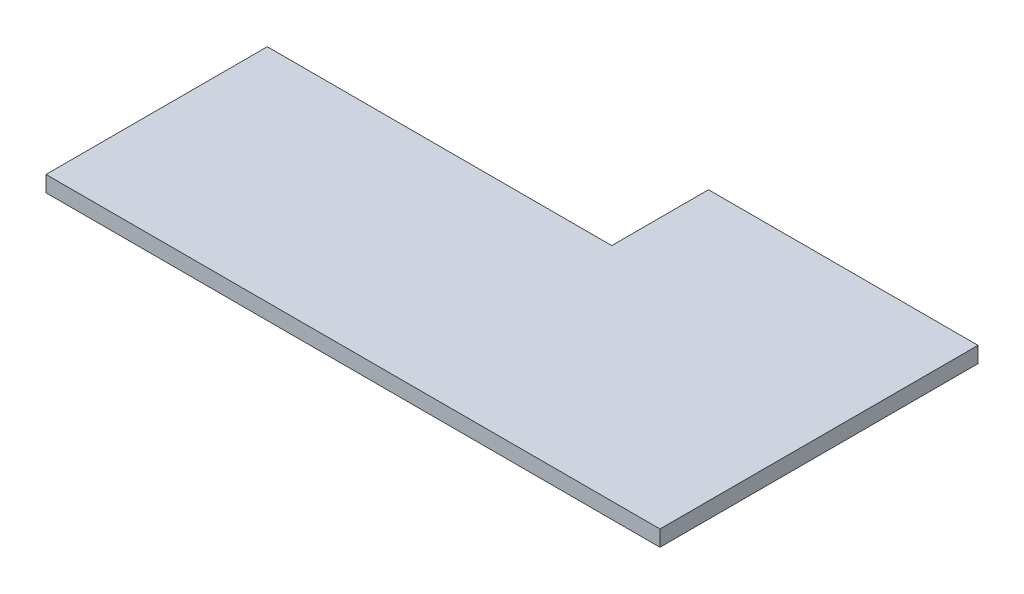
ISO-10303-21;
HEADER;
FILE_DESCRIPTION(('STEP AP214'),'2;1');
FILE_NAME('part.step','',(''),(''),'','','');
FILE_SCHEMA(('AUTOMOTIVE_DESIGN { 1 0 10303 214 1 1 1 1 }'));
ENDSEC;
DATA;
#1=APPLICATION_CONTEXT('core data for automotive mechanical design processes');
#2=APPLICATION_PROTOCOL_DEFINITION('international standard','automotive_design',2000,#1);
#3=PRODUCT_CONTEXT('',#1,'mechanical');
#4=PRODUCT('Part','Part','',(#3));
#5=PRODUCT_RELATED_PRODUCT_CATEGORY('part','',(#4));
#6=PRODUCT_DEFINITION_FORMATION('','',#4);
#7=PRODUCT_DEFINITION_CONTEXT('part definition',#1,'design');
#8=PRODUCT_DEFINITION('design','',#6,#7);
#9=PRODUCT_DEFINITION_SHAPE('','',#8);
#10=(LENGTH_UNIT() NAMED_UNIT(*) SI_UNIT(.MILLI.,.METRE.));
#11=(NAMED_UNIT(*) PLANE_ANGLE_UNIT() SI_UNIT($,.RADIAN.));
#12=(NAMED_UNIT(*) SI_UNIT($,.STERADIAN.) SOLID_ANGLE_UNIT());
#13=UNCERTAINTY_MEASURE_WITH_UNIT(LENGTH_MEASURE(1.E-05),#10,'distance_accuracy_value','');
#14=(GEOMETRIC_REPRESENTATION_CONTEXT(3) GLOBAL_UNCERTAINTY_ASSIGNED_CONTEXT((#13)) GLOBAL_UNIT_ASSIGNED_CONTEXT((#10,
#11,#12)) REPRESENTATION_CONTEXT('',''));
#15=CARTESIAN_POINT('',(0.,0.,0.));
#16=DIRECTION('',(0.,0.,1.));
#17=DIRECTION('',(1.,0.,0.));
#18=AXIS2_PLACEMENT_3D('',#15,#16,#17);
#19=CARTESIAN_POINT('',(0.,2.95,-13.6221046673799));
#20=DIRECTION('',(0.,0.,1.));
#21=DIRECTION('',(1.,0.,0.));
#22=AXIS2_PLACEMENT_3D('',#19,#20,#21);
#23=PLANE('',#22);
#24=DIRECTION('',(-1.,0.,0.));
#25=VECTOR('',#24,1.);
#26=CARTESIAN_POINT('',(0.,0.,-13.6221046673799));
#27=LINE('',#26,#25);
#28=CARTESIAN_POINT('',(0.,0.,-13.6221046673799));
#29=VERTEX_POINT('',#28);
#30=CARTESIAN_POINT('',(-63.91,0.,-13.6221046673799));
#31=VERTEX_POINT('',#30);
#32=EDGE_CURVE('E116',#29,#31,#27,.T.);
#33=ORIENTED_EDGE('',*,*,#32,.T.);
#34=DIRECTION('',(0.,-1.,0.));
#35=VECTOR('',#34,1.);
#36=CARTESIAN_POINT('',(-63.91,2.95,-13.6221046673799));
#37=LINE('',#36,#35);
#38=CARTESIAN_POINT('',(-63.91,2.95,-13.6221046673799));
#39=VERTEX_POINT('',#38);
#40=EDGE_CURVE('E11',#39,#31,#37,.T.);
#41=ORIENTED_EDGE('',*,*,#40,.F.);
#42=DIRECTION('',(-1.,0.,0.));
#43=VECTOR('',#42,1.);
#44=CARTESIAN_POINT('',(0.,2.95,-13.6221046673799));
#45=LINE('',#44,#43);
#46=CARTESIAN_POINT('',(0.,2.95,-13.6221046673799));
#47=VERTEX_POINT('',#46);
#48=EDGE_CURVE('E127',#47,#39,#45,.T.);
#49=ORIENTED_EDGE('',*,*,#48,.F.);
#50=DIRECTION('',(0.,-1.,0.));
#51=VECTOR('',#50,1.);
#52=CARTESIAN_POINT('',(0.,2.95,-13.6221046673799));
#53=LINE('',#52,#51);
#54=EDGE_CURVE('E112',#47,#29,#53,.T.);
#55=ORIENTED_EDGE('',*,*,#54,.T.);
#56=EDGE_LOOP('',(#33,#41,#49,#55));
#57=FACE_BOUND('',#56,.T.);
#58=ADVANCED_FACE('F33',(#57),#23,.F.);
#59=CARTESIAN_POINT('',(-63.91,2.95,-13.6221046673799));
#60=DIRECTION('',(1.,0.,0.));
#61=DIRECTION('',(0.,0.,-1.));
#62=AXIS2_PLACEMENT_3D('',#59,#60,#61);
#63=PLANE('',#62);
#64=DIRECTION('',(0.,0.,1.));
#65=VECTOR('',#64,1.);
#66=CARTESIAN_POINT('',(-63.91,0.,-13.6221046673799));
#67=LINE('',#66,#65);
#68=CARTESIAN_POINT('',(-63.91,0.,27.4278953326201));
#69=VERTEX_POINT('',#68);
#70=EDGE_CURVE('E119',#31,#69,#67,.T.);
#71=ORIENTED_EDGE('',*,*,#70,.T.);
#72=DIRECTION('',(0.,-1.,0.));
#73=VECTOR('',#72,1.);
#74=CARTESIAN_POINT('',(-63.91,2.95,27.4278953326201));
#75=LINE('',#74,#73);
#76=CARTESIAN_POINT('',(-63.91,2.95,27.4278953326201));
#77=VERTEX_POINT('',#76);
#78=EDGE_CURVE('E41',#77,#69,#75,.T.);
#79=ORIENTED_EDGE('',*,*,#78,.F.);
#80=DIRECTION('',(0.,0.,1.));
#81=VECTOR('',#80,1.);
#82=CARTESIAN_POINT('',(-63.91,2.95,-13.6221046673799));
#83=LINE('',#82,#81);
#84=EDGE_CURVE('E86',#39,#77,#83,.T.);
#85=ORIENTED_EDGE('',*,*,#84,.F.);
#86=ORIENTED_EDGE('',*,*,#40,.T.);
#87=EDGE_LOOP('',(#71,#79,#85,#86));
#88=FACE_BOUND('',#87,.T.);
#89=ADVANCED_FACE('F151',(#88),#63,.F.);
#90=CARTESIAN_POINT('',(-63.91,2.95,27.4278953326201));
#91=DIRECTION('',(0.,0.,-1.));
#92=DIRECTION('',(-1.,0.,0.));
#93=AXIS2_PLACEMENT_3D('',#90,#91,#92);
#94=PLANE('',#93);
#95=DIRECTION('',(1.,0.,0.));
#96=VECTOR('',#95,1.);
#97=CARTESIAN_POINT('',(-63.91,0.,27.4278953326201));
#98=LINE('',#97,#96);
#99=CARTESIAN_POINT('',(50.,0.,27.4278953326201));
#100=VERTEX_POINT('',#99);
#101=EDGE_CURVE('E121',#69,#100,#98,.T.);
#102=ORIENTED_EDGE('',*,*,#101,.T.);
#103=DIRECTION('',(0.,-1.,0.));
#104=VECTOR('',#103,1.);
#105=CARTESIAN_POINT('',(50.,2.95,27.4278953326201));
#106=LINE('',#105,#104);
#107=CARTESIAN_POINT('',(50.,2.95,27.4278953326201));
#108=VERTEX_POINT('',#107);
#109=EDGE_CURVE('E107',#108,#100,#106,.T.);
#110=ORIENTED_EDGE('',*,*,#109,.F.);
#111=DIRECTION('',(1.,0.,0.));
#112=VECTOR('',#111,1.);
#113=CARTESIAN_POINT('',(-63.91,2.95,27.4278953326201));
#114=LINE('',#113,#112);
#115=EDGE_CURVE('E99',#77,#108,#114,.T.);
#116=ORIENTED_EDGE('',*,*,#115,.F.);
#117=ORIENTED_EDGE('',*,*,#78,.T.);
#118=EDGE_LOOP('',(#102,#110,#116,#117));
#119=FACE_BOUND('',#118,.T.);
#120=ADVANCED_FACE('F133',(#119),#94,.F.);
#121=CARTESIAN_POINT('',(50.,2.95,-16.5721046673799));
#122=DIRECTION('',(-1.,0.,0.));
#123=DIRECTION('',(0.,0.,1.));
#124=AXIS2_PLACEMENT_3D('',#121,#122,#123);
#125=PLANE('',#124);
#126=DIRECTION('',(0.,0.,-1.));
#127=VECTOR('',#126,1.);
#128=CARTESIAN_POINT('',(50.,0.,-16.5721046673799));
#129=LINE('',#128,#127);
#130=CARTESIAN_POINT('',(50.,0.,-31.5721046673799));
#131=VERTEX_POINT('',#130);
#132=EDGE_CURVE('E106',#100,#131,#129,.T.);
#133=ORIENTED_EDGE('',*,*,#132,.T.);
#134=DIRECTION('',(0.,-1.,0.));
#135=VECTOR('',#134,1.);
#136=CARTESIAN_POINT('',(50.,2.95,-31.5721046673799));
#137=LINE('',#136,#135);
#138=CARTESIAN_POINT('',(50.,2.95,-31.5721046673799));
#139=VERTEX_POINT('',#138);
#140=EDGE_CURVE('E104',#139,#131,#137,.T.);
#141=ORIENTED_EDGE('',*,*,#140,.F.);
#142=DIRECTION('',(0.,0.,-1.));
#143=VECTOR('',#142,1.);
#144=CARTESIAN_POINT('',(50.,2.95,27.4278953326201));
#145=LINE('',#144,#143);
#146=EDGE_CURVE('E93',#108,#139,#145,.T.);
#147=ORIENTED_EDGE('',*,*,#146,.F.);
#148=ORIENTED_EDGE('',*,*,#109,.T.);
#149=EDGE_LOOP('',(#133,#141,#147,#148));
#150=FACE_BOUND('',#149,.T.);
#151=ADVANCED_FACE('F105',(#150),#125,.F.);
#152=CARTESIAN_POINT('',(50.,2.95,-31.5721046673799));
#153=DIRECTION('',(0.,0.,1.));
#154=DIRECTION('',(1.,0.,0.));
#155=AXIS2_PLACEMENT_3D('',#152,#153,#154);
#156=PLANE('',#155);
#157=DIRECTION('',(-1.,0.,0.));
#158=VECTOR('',#157,1.);
#159=CARTESIAN_POINT('',(50.,0.,-31.5721046673799));
#160=LINE('',#159,#158);
#161=CARTESIAN_POINT('',(0.,0.,-31.5721046673799));
#162=VERTEX_POINT('',#161);
#163=EDGE_CURVE('E72',#131,#162,#160,.T.);
#164=ORIENTED_EDGE('',*,*,#163,.T.);
#165=DIRECTION('',(0.,-1.,0.));
#166=VECTOR('',#165,1.);
#167=CARTESIAN_POINT('',(0.,2.95,-31.5721046673799));
#168=LINE('',#167,#166);
#169=CARTESIAN_POINT('',(0.,2.95,-31.5721046673799));
#170=VERTEX_POINT('',#169);
#171=EDGE_CURVE('E108',#170,#162,#168,.T.);
#172=ORIENTED_EDGE('',*,*,#171,.F.);
#173=DIRECTION('',(-1.,0.,0.));
#174=VECTOR('',#173,1.);
#175=CARTESIAN_POINT('',(50.,2.95,-31.5721046673799));
#176=LINE('',#175,#174);
#177=EDGE_CURVE('E97',#139,#170,#176,.T.);
#178=ORIENTED_EDGE('',*,*,#177,.F.);
#179=ORIENTED_EDGE('',*,*,#140,.T.);
#180=EDGE_LOOP('',(#164,#172,#178,#179));
#181=FACE_BOUND('',#180,.T.);
#182=ADVANCED_FACE('F110',(#181),#156,.F.);
#183=CARTESIAN_POINT('',(0.,2.95,-31.5721046673799));
#184=DIRECTION('',(1.,0.,0.));
#185=DIRECTION('',(0.,0.,-1.));
#186=AXIS2_PLACEMENT_3D('',#183,#184,#185);
#187=PLANE('',#186);
#188=DIRECTION('',(0.,0.,1.));
#189=VECTOR('',#188,1.);
#190=CARTESIAN_POINT('',(0.,0.,-31.5721046673799));
#191=LINE('',#190,#189);
#192=EDGE_CURVE('E78',#162,#29,#191,.T.);
#193=ORIENTED_EDGE('',*,*,#192,.T.);
#194=ORIENTED_EDGE('',*,*,#54,.F.);
#195=DIRECTION('',(0.,0.,1.));
#196=VECTOR('',#195,1.);
#197=CARTESIAN_POINT('',(0.,2.95,-31.5721046673799));
#198=LINE('',#197,#196);
#199=EDGE_CURVE('E49',#170,#47,#198,.T.);
#200=ORIENTED_EDGE('',*,*,#199,.F.);
#201=ORIENTED_EDGE('',*,*,#171,.T.);
#202=EDGE_LOOP('',(#193,#194,#200,#201));
#203=FACE_BOUND('',#202,.T.);
#204=ADVANCED_FACE('F140',(#203),#187,.F.);
#205=CARTESIAN_POINT('',(0.,2.95,0.));
#206=DIRECTION('',(0.,1.,0.));
#207=DIRECTION('',(0.,0.,1.));
#208=AXIS2_PLACEMENT_3D('',#205,#206,#207);
#209=PLANE('',#208);
#210=ORIENTED_EDGE('',*,*,#48,.T.);
#211=ORIENTED_EDGE('',*,*,#84,.T.);
#212=ORIENTED_EDGE('',*,*,#115,.T.);
#213=ORIENTED_EDGE('',*,*,#146,.T.);
#214=ORIENTED_EDGE('',*,*,#177,.T.);
#215=ORIENTED_EDGE('',*,*,#199,.T.);
#216=EDGE_LOOP('',(#210,#211,#212,#213,#214,#215));
#217=FACE_BOUND('',#216,.T.);
#218=ADVANCED_FACE('F95',(#217),#209,.T.);
#219=CARTESIAN_POINT('',(0.,0.,0.));
#220=DIRECTION('',(0.,1.,0.));
#221=DIRECTION('',(0.,0.,1.));
#222=AXIS2_PLACEMENT_3D('',#219,#220,#221);
#223=PLANE('',#222);
#224=ORIENTED_EDGE('',*,*,#32,.F.);
#225=ORIENTED_EDGE('',*,*,#192,.F.);
#226=ORIENTED_EDGE('',*,*,#163,.F.);
#227=ORIENTED_EDGE('',*,*,#132,.F.);
#228=ORIENTED_EDGE('',*,*,#101,.F.);
#229=ORIENTED_EDGE('',*,*,#70,.F.);
#230=EDGE_LOOP('',(#224,#225,#226,#227,#228,#229));
#231=FACE_BOUND('',#230,.T.);
#232=ADVANCED_FACE('F136',(#231),#223,.F.);
#233=CLOSED_SHELL('',(#58,#89,#120,#151,#182,#204,#218,#232));
#234=MANIFOLD_SOLID_BREP('B2',#233);
#235=ADVANCED_BREP_SHAPE_REPRESENTATION('',(#18,#234),#14);
#236=SHAPE_DEFINITION_REPRESENTATION(#9,#235);
ENDSEC;
END-ISO-10303-21;
